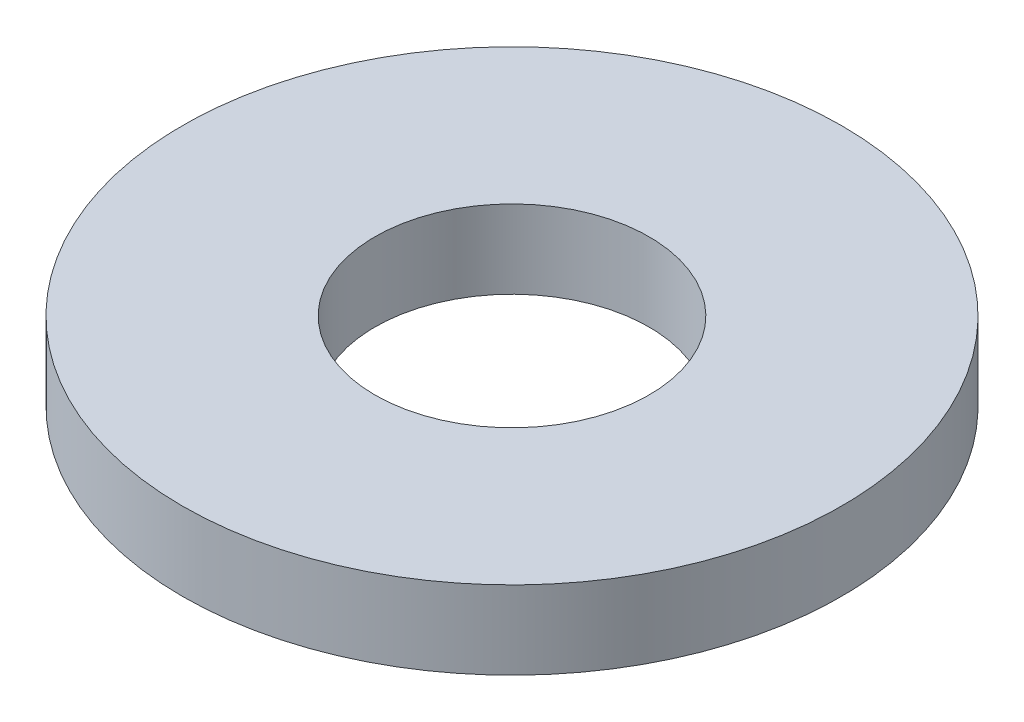
ISO-10303-21;
HEADER;
FILE_DESCRIPTION(('STEP AP214'),'2;1');
FILE_NAME('part.step','',(''),(''),'','','');
FILE_SCHEMA(('AUTOMOTIVE_DESIGN { 1 0 10303 214 1 1 1 1 }'));
ENDSEC;
DATA;
#1=APPLICATION_CONTEXT('core data for automotive mechanical design processes');
#2=APPLICATION_PROTOCOL_DEFINITION('international standard','automotive_design',2000,#1);
#3=PRODUCT_CONTEXT('',#1,'mechanical');
#4=PRODUCT('Part','Part','',(#3));
#5=PRODUCT_RELATED_PRODUCT_CATEGORY('part','',(#4));
#6=PRODUCT_DEFINITION_FORMATION('','',#4);
#7=PRODUCT_DEFINITION_CONTEXT('part definition',#1,'design');
#8=PRODUCT_DEFINITION('design','',#6,#7);
#9=PRODUCT_DEFINITION_SHAPE('','',#8);
#10=(LENGTH_UNIT() NAMED_UNIT(*) SI_UNIT(.MILLI.,.METRE.));
#11=(NAMED_UNIT(*) PLANE_ANGLE_UNIT() SI_UNIT($,.RADIAN.));
#12=(NAMED_UNIT(*) SI_UNIT($,.STERADIAN.) SOLID_ANGLE_UNIT());
#13=UNCERTAINTY_MEASURE_WITH_UNIT(LENGTH_MEASURE(1.E-05),#10,'distance_accuracy_value','');
#14=(GEOMETRIC_REPRESENTATION_CONTEXT(3) GLOBAL_UNCERTAINTY_ASSIGNED_CONTEXT((#13)) GLOBAL_UNIT_ASSIGNED_CONTEXT((#10,
#11,#12)) REPRESENTATION_CONTEXT('',''));
#15=CARTESIAN_POINT('',(0.,0.,0.));
#16=DIRECTION('',(0.,0.,1.));
#17=DIRECTION('',(1.,0.,0.));
#18=AXIS2_PLACEMENT_3D('',#15,#16,#17);
#19=CARTESIAN_POINT('',(0.,1.1303,0.));
#20=DIRECTION('',(0.,1.,0.));
#21=DIRECTION('',(0.,0.,1.));
#22=AXIS2_PLACEMENT_3D('',#19,#20,#21);
#23=PLANE('',#22);
#24=CARTESIAN_POINT('',(0.,1.1303,0.));
#25=DIRECTION('',(0.,1.,0.));
#26=DIRECTION('',(0.,0.,1.));
#27=AXIS2_PLACEMENT_3D('',#24,#25,#26);
#28=CIRCLE('',#27,4.7625);
#29=CARTESIAN_POINT('',(0.,1.1303,4.7625));
#30=VERTEX_POINT('',#29);
#31=EDGE_CURVE('E10',#30,#30,#28,.T.);
#32=ORIENTED_EDGE('',*,*,#31,.T.);
#33=EDGE_LOOP('',(#32));
#34=FACE_BOUND('',#33,.T.);
#35=CARTESIAN_POINT('',(0.,1.1303,0.));
#36=DIRECTION('',(0.,1.,0.));
#37=DIRECTION('',(0.,0.,1.));
#38=AXIS2_PLACEMENT_3D('',#35,#36,#37);
#39=CIRCLE('',#38,1.9812);
#40=CARTESIAN_POINT('',(0.,1.1303,1.9812));
#41=VERTEX_POINT('',#40);
#42=EDGE_CURVE('E42',#41,#41,#39,.T.);
#43=ORIENTED_EDGE('',*,*,#42,.F.);
#44=EDGE_LOOP('',(#43));
#45=FACE_BOUND('',#44,.T.);
#46=ADVANCED_FACE('F31',(#34,#45),#23,.T.);
#47=CARTESIAN_POINT('',(0.,0.,0.));
#48=DIRECTION('',(0.,1.,0.));
#49=DIRECTION('',(0.,0.,1.));
#50=AXIS2_PLACEMENT_3D('',#47,#48,#49);
#51=PLANE('',#50);
#52=CARTESIAN_POINT('',(0.,0.,0.));
#53=DIRECTION('',(0.,1.,0.));
#54=DIRECTION('',(0.,0.,1.));
#55=AXIS2_PLACEMENT_3D('',#52,#53,#54);
#56=CIRCLE('',#55,4.7625);
#57=CARTESIAN_POINT('',(0.,0.,4.7625));
#58=VERTEX_POINT('',#57);
#59=EDGE_CURVE('E35',#58,#58,#56,.T.);
#60=ORIENTED_EDGE('',*,*,#59,.F.);
#61=EDGE_LOOP('',(#60));
#62=FACE_BOUND('',#61,.T.);
#63=CARTESIAN_POINT('',(0.,0.,0.));
#64=DIRECTION('',(0.,1.,0.));
#65=DIRECTION('',(0.,0.,1.));
#66=AXIS2_PLACEMENT_3D('',#63,#64,#65);
#67=CIRCLE('',#66,1.9812);
#68=CARTESIAN_POINT('',(0.,0.,1.9812));
#69=VERTEX_POINT('',#68);
#70=EDGE_CURVE('E44',#69,#69,#67,.T.);
#71=ORIENTED_EDGE('',*,*,#70,.T.);
#72=EDGE_LOOP('',(#71));
#73=FACE_BOUND('',#72,.T.);
#74=ADVANCED_FACE('F54',(#62,#73),#51,.F.);
#75=CARTESIAN_POINT('',(0.,1.1303,0.));
#76=DIRECTION('',(0.,-1.,0.));
#77=DIRECTION('',(0.,0.,-1.));
#78=AXIS2_PLACEMENT_3D('',#75,#76,#77);
#79=CYLINDRICAL_SURFACE('',#78,4.7625);
#80=ORIENTED_EDGE('',*,*,#31,.F.);
#81=EDGE_LOOP('',(#80));
#82=FACE_BOUND('',#81,.T.);
#83=ORIENTED_EDGE('',*,*,#59,.T.);
#84=EDGE_LOOP('',(#83));
#85=FACE_BOUND('',#84,.T.);
#86=ADVANCED_FACE('F33',(#82,#85),#79,.T.);
#87=CARTESIAN_POINT('',(0.,1.1303,0.));
#88=DIRECTION('',(0.,-1.,0.));
#89=DIRECTION('',(0.,0.,-1.));
#90=AXIS2_PLACEMENT_3D('',#87,#88,#89);
#91=CYLINDRICAL_SURFACE('',#90,1.9812);
#92=ORIENTED_EDGE('',*,*,#42,.T.);
#93=EDGE_LOOP('',(#92));
#94=FACE_BOUND('',#93,.T.);
#95=ORIENTED_EDGE('',*,*,#70,.F.);
#96=EDGE_LOOP('',(#95));
#97=FACE_BOUND('',#96,.T.);
#98=ADVANCED_FACE('F50',(#94,#97),#91,.F.);
#99=CLOSED_SHELL('',(#46,#74,#86,#98));
#100=MANIFOLD_SOLID_BREP('B2',#99);
#101=ADVANCED_BREP_SHAPE_REPRESENTATION('',(#18,#100),#14);
#102=SHAPE_DEFINITION_REPRESENTATION(#9,#101);
ENDSEC;
END-ISO-10303-21;
